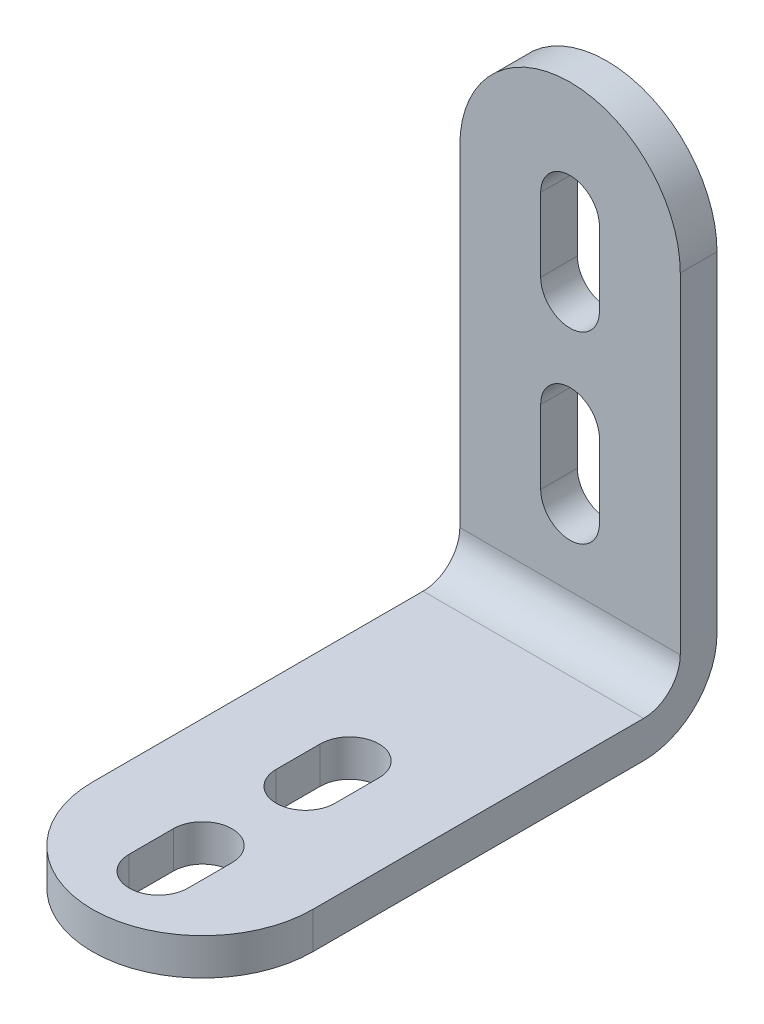
ISO-10303-21;
HEADER;
FILE_DESCRIPTION(('STEP AP214'),'2;1');
FILE_NAME('part.step','',(''),(''),'','','');
FILE_SCHEMA(('AUTOMOTIVE_DESIGN { 1 0 10303 214 1 1 1 1 }'));
ENDSEC;
DATA;
#1=APPLICATION_CONTEXT('core data for automotive mechanical design processes');
#2=APPLICATION_PROTOCOL_DEFINITION('international standard','automotive_design',2000,#1);
#3=PRODUCT_CONTEXT('',#1,'mechanical');
#4=PRODUCT('Part','Part','',(#3));
#5=PRODUCT_RELATED_PRODUCT_CATEGORY('part','',(#4));
#6=PRODUCT_DEFINITION_FORMATION('','',#4);
#7=PRODUCT_DEFINITION_CONTEXT('part definition',#1,'design');
#8=PRODUCT_DEFINITION('design','',#6,#7);
#9=PRODUCT_DEFINITION_SHAPE('','',#8);
#10=(LENGTH_UNIT() NAMED_UNIT(*) SI_UNIT(.MILLI.,.METRE.));
#11=(NAMED_UNIT(*) PLANE_ANGLE_UNIT() SI_UNIT($,.RADIAN.));
#12=(NAMED_UNIT(*) SI_UNIT($,.STERADIAN.) SOLID_ANGLE_UNIT());
#13=UNCERTAINTY_MEASURE_WITH_UNIT(LENGTH_MEASURE(1.E-05),#10,'distance_accuracy_value','');
#14=(GEOMETRIC_REPRESENTATION_CONTEXT(3) GLOBAL_UNCERTAINTY_ASSIGNED_CONTEXT((#13)) GLOBAL_UNIT_ASSIGNED_CONTEXT((#10,
#11,#12)) REPRESENTATION_CONTEXT('',''));
#15=CARTESIAN_POINT('',(0.,0.,0.));
#16=DIRECTION('',(0.,0.,1.));
#17=DIRECTION('',(1.,0.,0.));
#18=AXIS2_PLACEMENT_3D('',#15,#16,#17);
#19=CARTESIAN_POINT('',(0.,0.,55.));
#20=DIRECTION('',(0.,1.,0.));
#21=DIRECTION('',(0.,0.,1.));
#22=AXIS2_PLACEMENT_3D('',#19,#20,#21);
#23=CYLINDRICAL_SURFACE('',#22,15.);
#24=DIRECTION('',(0.,1.,0.));
#25=VECTOR('',#24,1.);
#26=CARTESIAN_POINT('',(-15.,0.,55.));
#27=LINE('',#26,#25);
#28=CARTESIAN_POINT('',(-15.,0.,55.));
#29=VERTEX_POINT('',#28);
#30=CARTESIAN_POINT('',(-15.,4.99999999999999,55.));
#31=VERTEX_POINT('',#30);
#32=EDGE_CURVE('E378',#29,#31,#27,.T.);
#33=ORIENTED_EDGE('',*,*,#32,.F.);
#34=CARTESIAN_POINT('',(0.,0.,55.));
#35=DIRECTION('',(0.,1.,0.));
#36=DIRECTION('',(0.,0.,1.));
#37=AXIS2_PLACEMENT_3D('',#34,#35,#36);
#38=CIRCLE('',#37,15.);
#39=CARTESIAN_POINT('',(15.,0.,55.));
#40=VERTEX_POINT('',#39);
#41=EDGE_CURVE('E42',#40,#29,#38,.F.);
#42=ORIENTED_EDGE('',*,*,#41,.F.);
#43=DIRECTION('',(0.,-1.,0.));
#44=VECTOR('',#43,1.);
#45=CARTESIAN_POINT('',(15.,70.,55.));
#46=LINE('',#45,#44);
#47=CARTESIAN_POINT('',(15.,4.99999999999999,55.));
#48=VERTEX_POINT('',#47);
#49=EDGE_CURVE('E381',#48,#40,#46,.T.);
#50=ORIENTED_EDGE('',*,*,#49,.F.);
#51=CARTESIAN_POINT('',(0.,4.99999999999999,55.));
#52=DIRECTION('',(0.,1.,0.));
#53=DIRECTION('',(0.,0.,1.));
#54=AXIS2_PLACEMENT_3D('',#51,#52,#53);
#55=CIRCLE('',#54,15.);
#56=EDGE_CURVE('E11',#31,#48,#55,.T.);
#57=ORIENTED_EDGE('',*,*,#56,.F.);
#58=EDGE_LOOP('',(#33,#42,#50,#57));
#59=FACE_BOUND('',#58,.T.);
#60=ADVANCED_FACE('F35',(#59),#23,.T.);
#61=CARTESIAN_POINT('',(0.,55.,5.00000000000001));
#62=DIRECTION('',(0.,0.,1.));
#63=DIRECTION('',(0.,-1.,0.));
#64=AXIS2_PLACEMENT_3D('',#61,#62,#63);
#65=CYLINDRICAL_SURFACE('',#64,15.);
#66=DIRECTION('',(0.,0.,1.));
#67=VECTOR('',#66,1.);
#68=CARTESIAN_POINT('',(-15.,55.,10.0000000000001));
#69=LINE('',#68,#67);
#70=CARTESIAN_POINT('',(-15.,55.,5.00000000000001));
#71=VERTEX_POINT('',#70);
#72=CARTESIAN_POINT('',(-15.,55.,0.));
#73=VERTEX_POINT('',#72);
#74=EDGE_CURVE('E349',#71,#73,#69,.F.);
#75=ORIENTED_EDGE('',*,*,#74,.F.);
#76=CARTESIAN_POINT('',(0.,55.,5.00000000000001));
#77=DIRECTION('',(0.,0.,1.));
#78=DIRECTION('',(0.,-1.,0.));
#79=AXIS2_PLACEMENT_3D('',#76,#77,#78);
#80=CIRCLE('',#79,15.);
#81=CARTESIAN_POINT('',(15.,55.,5.00000000000001));
#82=VERTEX_POINT('',#81);
#83=EDGE_CURVE('E374',#82,#71,#80,.T.);
#84=ORIENTED_EDGE('',*,*,#83,.F.);
#85=DIRECTION('',(0.,0.,-1.));
#86=VECTOR('',#85,1.);
#87=CARTESIAN_POINT('',(15.,55.,0.));
#88=LINE('',#87,#86);
#89=CARTESIAN_POINT('',(15.,55.,0.));
#90=VERTEX_POINT('',#89);
#91=EDGE_CURVE('E371',#90,#82,#88,.F.);
#92=ORIENTED_EDGE('',*,*,#91,.F.);
#93=CARTESIAN_POINT('',(0.,55.,0.));
#94=DIRECTION('',(0.,0.,1.));
#95=DIRECTION('',(0.,-1.,0.));
#96=AXIS2_PLACEMENT_3D('',#93,#94,#95);
#97=CIRCLE('',#96,15.);
#98=EDGE_CURVE('E376',#73,#90,#97,.F.);
#99=ORIENTED_EDGE('',*,*,#98,.F.);
#100=EDGE_LOOP('',(#75,#84,#92,#99));
#101=FACE_BOUND('',#100,.T.);
#102=ADVANCED_FACE('F417',(#101),#65,.T.);
#103=CARTESIAN_POINT('',(-15.,0.,10.0000000000001));
#104=DIRECTION('',(-1.,0.,0.));
#105=DIRECTION('',(0.,0.,1.));
#106=AXIS2_PLACEMENT_3D('',#103,#104,#105);
#107=PLANE('',#106);
#108=DIRECTION('',(0.,0.,1.));
#109=VECTOR('',#108,1.);
#110=CARTESIAN_POINT('',(-15.,0.,10.0000000000001));
#111=LINE('',#110,#109);
#112=CARTESIAN_POINT('',(-15.,0.,10.0000000000001));
#113=VERTEX_POINT('',#112);
#114=EDGE_CURVE('E356',#113,#29,#111,.T.);
#115=ORIENTED_EDGE('',*,*,#114,.T.);
#116=ORIENTED_EDGE('',*,*,#32,.T.);
#117=DIRECTION('',(0.,0.,1.));
#118=VECTOR('',#117,1.);
#119=CARTESIAN_POINT('',(-15.,5.,10.0000000000001));
#120=LINE('',#119,#118);
#121=CARTESIAN_POINT('',(-15.,5.,10.0000000000001));
#122=VERTEX_POINT('',#121);
#123=EDGE_CURVE('E335',#122,#31,#120,.T.);
#124=ORIENTED_EDGE('',*,*,#123,.F.);
#125=CARTESIAN_POINT('',(-15.,10.,10.));
#126=DIRECTION('',(1.,0.,0.));
#127=DIRECTION('',(0.,0.,-1.));
#128=AXIS2_PLACEMENT_3D('',#125,#126,#127);
#129=CIRCLE('',#128,5.);
#130=CARTESIAN_POINT('',(-15.,10.,5.));
#131=VERTEX_POINT('',#130);
#132=EDGE_CURVE('E330',#131,#122,#129,.F.);
#133=ORIENTED_EDGE('',*,*,#132,.F.);
#134=DIRECTION('',(0.,-1.,0.));
#135=VECTOR('',#134,1.);
#136=CARTESIAN_POINT('',(-15.,70.,5.00000000000001));
#137=LINE('',#136,#135);
#138=EDGE_CURVE('E339',#71,#131,#137,.T.);
#139=ORIENTED_EDGE('',*,*,#138,.F.);
#140=ORIENTED_EDGE('',*,*,#74,.T.);
#141=DIRECTION('',(0.,-1.,0.));
#142=VECTOR('',#141,1.);
#143=CARTESIAN_POINT('',(-15.,70.,0.));
#144=LINE('',#143,#142);
#145=CARTESIAN_POINT('',(-15.,10.0000000000001,0.));
#146=VERTEX_POINT('',#145);
#147=EDGE_CURVE('E344',#73,#146,#144,.T.);
#148=ORIENTED_EDGE('',*,*,#147,.T.);
#149=CARTESIAN_POINT('',(-15.,10.,10.));
#150=DIRECTION('',(-1.,0.,0.));
#151=DIRECTION('',(0.,0.,1.));
#152=AXIS2_PLACEMENT_3D('',#149,#150,#151);
#153=CIRCLE('',#152,10.);
#154=EDGE_CURVE('E352',#146,#113,#153,.T.);
#155=ORIENTED_EDGE('',*,*,#154,.T.);
#156=EDGE_LOOP('',(#115,#116,#124,#133,#139,#140,#148,#155));
#157=FACE_BOUND('',#156,.T.);
#158=ADVANCED_FACE('F392',(#157),#107,.T.);
#159=CARTESIAN_POINT('',(15.,70.,0.));
#160=DIRECTION('',(-1.,0.,0.));
#161=DIRECTION('',(0.,-1.,0.));
#162=AXIS2_PLACEMENT_3D('',#159,#160,#161);
#163=PLANE('',#162);
#164=DIRECTION('',(0.,0.,1.));
#165=VECTOR('',#164,1.);
#166=CARTESIAN_POINT('',(15.,5.,10.0000000000001));
#167=LINE('',#166,#165);
#168=CARTESIAN_POINT('',(15.,5.,10.));
#169=VERTEX_POINT('',#168);
#170=EDGE_CURVE('E336',#169,#48,#167,.T.);
#171=ORIENTED_EDGE('',*,*,#170,.T.);
#172=ORIENTED_EDGE('',*,*,#49,.T.);
#173=DIRECTION('',(0.,0.,1.));
#174=VECTOR('',#173,1.);
#175=CARTESIAN_POINT('',(15.,0.,10.0000000000001));
#176=LINE('',#175,#174);
#177=CARTESIAN_POINT('',(15.,0.,10.0000000000001));
#178=VERTEX_POINT('',#177);
#179=EDGE_CURVE('E320',#178,#40,#176,.T.);
#180=ORIENTED_EDGE('',*,*,#179,.F.);
#181=CARTESIAN_POINT('',(15.,10.,10.));
#182=DIRECTION('',(-1.,0.,0.));
#183=DIRECTION('',(0.,0.,1.));
#184=AXIS2_PLACEMENT_3D('',#181,#182,#183);
#185=CIRCLE('',#184,10.);
#186=CARTESIAN_POINT('',(15.,10.0000000000001,0.));
#187=VERTEX_POINT('',#186);
#188=EDGE_CURVE('E359',#187,#178,#185,.T.);
#189=ORIENTED_EDGE('',*,*,#188,.F.);
#190=DIRECTION('',(0.,-1.,0.));
#191=VECTOR('',#190,1.);
#192=CARTESIAN_POINT('',(15.,70.,0.));
#193=LINE('',#192,#191);
#194=EDGE_CURVE('E351',#90,#187,#193,.T.);
#195=ORIENTED_EDGE('',*,*,#194,.F.);
#196=ORIENTED_EDGE('',*,*,#91,.T.);
#197=DIRECTION('',(0.,-1.,0.));
#198=VECTOR('',#197,1.);
#199=CARTESIAN_POINT('',(15.,70.,5.00000000000001));
#200=LINE('',#199,#198);
#201=CARTESIAN_POINT('',(15.,10.0000000000001,5.));
#202=VERTEX_POINT('',#201);
#203=EDGE_CURVE('E337',#82,#202,#200,.T.);
#204=ORIENTED_EDGE('',*,*,#203,.T.);
#205=CARTESIAN_POINT('',(15.,10.,10.));
#206=DIRECTION('',(1.,0.,0.));
#207=DIRECTION('',(0.,0.,-1.));
#208=AXIS2_PLACEMENT_3D('',#205,#206,#207);
#209=CIRCLE('',#208,5.);
#210=EDGE_CURVE('E331',#202,#169,#209,.F.);
#211=ORIENTED_EDGE('',*,*,#210,.T.);
#212=EDGE_LOOP('',(#171,#172,#180,#189,#195,#196,#204,#211));
#213=FACE_BOUND('',#212,.T.);
#214=ADVANCED_FACE('F401',(#213),#163,.F.);
#215=CARTESIAN_POINT('',(-15.,70.,5.00000000000001));
#216=DIRECTION('',(0.,0.,1.));
#217=DIRECTION('',(0.,-1.,0.));
#218=AXIS2_PLACEMENT_3D('',#215,#216,#217);
#219=PLANE('',#218);
#220=CARTESIAN_POINT('',(0.,20.,5.));
#221=DIRECTION('',(0.,0.,1.));
#222=DIRECTION('',(1.,0.,0.));
#223=AXIS2_PLACEMENT_3D('',#220,#221,#222);
#224=CIRCLE('',#223,4.);
#225=CARTESIAN_POINT('',(-4.,20.,5.));
#226=VERTEX_POINT('',#225);
#227=CARTESIAN_POINT('',(4.00000000000001,20.,5.));
#228=VERTEX_POINT('',#227);
#229=EDGE_CURVE('E49',#226,#228,#224,.T.);
#230=ORIENTED_EDGE('',*,*,#229,.F.);
#231=DIRECTION('',(0.,-1.,0.));
#232=VECTOR('',#231,1.);
#233=CARTESIAN_POINT('',(-4.,20.,5.));
#234=LINE('',#233,#232);
#235=CARTESIAN_POINT('',(-4.,30.,5.));
#236=VERTEX_POINT('',#235);
#237=EDGE_CURVE('E212',#236,#226,#234,.T.);
#238=ORIENTED_EDGE('',*,*,#237,.F.);
#239=CARTESIAN_POINT('',(0.,30.,5.));
#240=DIRECTION('',(0.,0.,1.));
#241=DIRECTION('',(1.,0.,0.));
#242=AXIS2_PLACEMENT_3D('',#239,#240,#241);
#243=CIRCLE('',#242,4.);
#244=CARTESIAN_POINT('',(4.,30.,5.));
#245=VERTEX_POINT('',#244);
#246=EDGE_CURVE('E215',#245,#236,#243,.T.);
#247=ORIENTED_EDGE('',*,*,#246,.F.);
#248=DIRECTION('',(0.,1.,0.));
#249=VECTOR('',#248,1.);
#250=CARTESIAN_POINT('',(4.00000000000001,20.,5.));
#251=LINE('',#250,#249);
#252=EDGE_CURVE('E221',#228,#245,#251,.T.);
#253=ORIENTED_EDGE('',*,*,#252,.F.);
#254=EDGE_LOOP('',(#230,#238,#247,#253));
#255=FACE_BOUND('',#254,.T.);
#256=CARTESIAN_POINT('',(0.,55.,5.));
#257=DIRECTION('',(0.,0.,1.));
#258=DIRECTION('',(1.,0.,0.));
#259=AXIS2_PLACEMENT_3D('',#256,#257,#258);
#260=CIRCLE('',#259,4.00000000000002);
#261=CARTESIAN_POINT('',(4.00000000000002,55.,5.));
#262=VERTEX_POINT('',#261);
#263=CARTESIAN_POINT('',(-4.00000000000002,55.,5.00000000000001));
#264=VERTEX_POINT('',#263);
#265=EDGE_CURVE('E227',#262,#264,#260,.T.);
#266=ORIENTED_EDGE('',*,*,#265,.F.);
#267=DIRECTION('',(0.,1.,0.));
#268=VECTOR('',#267,1.);
#269=CARTESIAN_POINT('',(4.00000000000002,55.,5.));
#270=LINE('',#269,#268);
#271=CARTESIAN_POINT('',(4.00000000000002,45.,5.));
#272=VERTEX_POINT('',#271);
#273=EDGE_CURVE('E235',#272,#262,#270,.T.);
#274=ORIENTED_EDGE('',*,*,#273,.F.);
#275=CARTESIAN_POINT('',(0.,45.,5.));
#276=DIRECTION('',(0.,0.,1.));
#277=DIRECTION('',(1.,0.,0.));
#278=AXIS2_PLACEMENT_3D('',#275,#276,#277);
#279=CIRCLE('',#278,4.00000000000002);
#280=CARTESIAN_POINT('',(-4.00000000000001,45.,5.));
#281=VERTEX_POINT('',#280);
#282=EDGE_CURVE('E249',#281,#272,#279,.T.);
#283=ORIENTED_EDGE('',*,*,#282,.F.);
#284=DIRECTION('',(0.,-1.,0.));
#285=VECTOR('',#284,1.);
#286=CARTESIAN_POINT('',(-4.00000000000001,55.,5.));
#287=LINE('',#286,#285);
#288=EDGE_CURVE('E246',#264,#281,#287,.T.);
#289=ORIENTED_EDGE('',*,*,#288,.F.);
#290=EDGE_LOOP('',(#266,#274,#283,#289));
#291=FACE_BOUND('',#290,.T.);
#292=ORIENTED_EDGE('',*,*,#203,.F.);
#293=ORIENTED_EDGE('',*,*,#83,.T.);
#294=ORIENTED_EDGE('',*,*,#138,.T.);
#295=DIRECTION('',(1.,0.,0.));
#296=VECTOR('',#295,1.);
#297=CARTESIAN_POINT('',(-15.,10.0000000000001,5.));
#298=LINE('',#297,#296);
#299=EDGE_CURVE('E327',#131,#202,#298,.T.);
#300=ORIENTED_EDGE('',*,*,#299,.T.);
#301=EDGE_LOOP('',(#292,#293,#294,#300));
#302=FACE_BOUND('',#301,.T.);
#303=ADVANCED_FACE('F413',(#255,#291,#302),#219,.T.);
#304=CARTESIAN_POINT('',(-15.,10.,10.));
#305=DIRECTION('',(1.,0.,0.));
#306=DIRECTION('',(0.,0.,-1.));
#307=AXIS2_PLACEMENT_3D('',#304,#305,#306);
#308=CYLINDRICAL_SURFACE('',#307,5.);
#309=ORIENTED_EDGE('',*,*,#210,.F.);
#310=ORIENTED_EDGE('',*,*,#299,.F.);
#311=ORIENTED_EDGE('',*,*,#132,.T.);
#312=DIRECTION('',(1.,0.,0.));
#313=VECTOR('',#312,1.);
#314=CARTESIAN_POINT('',(-15.,5.,10.));
#315=LINE('',#314,#313);
#316=EDGE_CURVE('E332',#122,#169,#315,.T.);
#317=ORIENTED_EDGE('',*,*,#316,.T.);
#318=EDGE_LOOP('',(#309,#310,#311,#317));
#319=FACE_BOUND('',#318,.T.);
#320=ADVANCED_FACE('F410',(#319),#308,.F.);
#321=CARTESIAN_POINT('',(-15.,5.,10.0000000000001));
#322=DIRECTION('',(0.,1.,0.));
#323=DIRECTION('',(0.,0.,1.));
#324=AXIS2_PLACEMENT_3D('',#321,#322,#323);
#325=PLANE('',#324);
#326=CARTESIAN_POINT('',(0.,4.99999999999999,55.));
#327=DIRECTION('',(0.,1.,0.));
#328=DIRECTION('',(0.,0.,1.));
#329=AXIS2_PLACEMENT_3D('',#326,#327,#328);
#330=CIRCLE('',#329,4.);
#331=CARTESIAN_POINT('',(4.,4.99999999999999,55.));
#332=VERTEX_POINT('',#331);
#333=CARTESIAN_POINT('',(-4.,4.99999999999999,55.));
#334=VERTEX_POINT('',#333);
#335=EDGE_CURVE('E256',#332,#334,#330,.T.);
#336=ORIENTED_EDGE('',*,*,#335,.F.);
#337=DIRECTION('',(0.,0.,-1.));
#338=VECTOR('',#337,1.);
#339=CARTESIAN_POINT('',(4.,4.99999999999999,55.));
#340=LINE('',#339,#338);
#341=CARTESIAN_POINT('',(4.,4.99999999999999,61.));
#342=VERTEX_POINT('',#341);
#343=EDGE_CURVE('E267',#342,#332,#340,.T.);
#344=ORIENTED_EDGE('',*,*,#343,.F.);
#345=CARTESIAN_POINT('',(0.,4.99999999999999,61.));
#346=DIRECTION('',(0.,1.,0.));
#347=DIRECTION('',(0.,0.,1.));
#348=AXIS2_PLACEMENT_3D('',#345,#346,#347);
#349=CIRCLE('',#348,4.);
#350=CARTESIAN_POINT('',(-4.,4.99999999999999,61.));
#351=VERTEX_POINT('',#350);
#352=EDGE_CURVE('E281',#351,#342,#349,.T.);
#353=ORIENTED_EDGE('',*,*,#352,.F.);
#354=DIRECTION('',(0.,0.,1.));
#355=VECTOR('',#354,1.);
#356=CARTESIAN_POINT('',(-4.,4.99999999999999,55.));
#357=LINE('',#356,#355);
#358=EDGE_CURVE('E278',#334,#351,#357,.T.);
#359=ORIENTED_EDGE('',*,*,#358,.F.);
#360=EDGE_LOOP('',(#336,#344,#353,#359));
#361=FACE_BOUND('',#360,.T.);
#362=CARTESIAN_POINT('',(0.,5.,35.));
#363=DIRECTION('',(0.,1.,0.));
#364=DIRECTION('',(0.,0.,1.));
#365=AXIS2_PLACEMENT_3D('',#362,#363,#364);
#366=CIRCLE('',#365,4.);
#367=CARTESIAN_POINT('',(4.,5.,35.));
#368=VERTEX_POINT('',#367);
#369=CARTESIAN_POINT('',(-4.,5.,35.));
#370=VERTEX_POINT('',#369);
#371=EDGE_CURVE('E288',#368,#370,#366,.T.);
#372=ORIENTED_EDGE('',*,*,#371,.F.);
#373=DIRECTION('',(0.,0.,-1.));
#374=VECTOR('',#373,1.);
#375=CARTESIAN_POINT('',(4.,5.,35.));
#376=LINE('',#375,#374);
#377=CARTESIAN_POINT('',(4.,5.,41.));
#378=VERTEX_POINT('',#377);
#379=EDGE_CURVE('E299',#378,#368,#376,.T.);
#380=ORIENTED_EDGE('',*,*,#379,.F.);
#381=CARTESIAN_POINT('',(0.,5.,41.));
#382=DIRECTION('',(0.,1.,0.));
#383=DIRECTION('',(0.,0.,1.));
#384=AXIS2_PLACEMENT_3D('',#381,#382,#383);
#385=CIRCLE('',#384,4.);
#386=CARTESIAN_POINT('',(-4.,5.,41.));
#387=VERTEX_POINT('',#386);
#388=EDGE_CURVE('E313',#387,#378,#385,.T.);
#389=ORIENTED_EDGE('',*,*,#388,.F.);
#390=DIRECTION('',(0.,0.,1.));
#391=VECTOR('',#390,1.);
#392=CARTESIAN_POINT('',(-4.,5.,35.));
#393=LINE('',#392,#391);
#394=EDGE_CURVE('E310',#370,#387,#393,.T.);
#395=ORIENTED_EDGE('',*,*,#394,.F.);
#396=EDGE_LOOP('',(#372,#380,#389,#395));
#397=FACE_BOUND('',#396,.T.);
#398=ORIENTED_EDGE('',*,*,#123,.T.);
#399=ORIENTED_EDGE('',*,*,#56,.T.);
#400=ORIENTED_EDGE('',*,*,#170,.F.);
#401=ORIENTED_EDGE('',*,*,#316,.F.);
#402=EDGE_LOOP('',(#398,#399,#400,#401));
#403=FACE_BOUND('',#402,.T.);
#404=ADVANCED_FACE('F405',(#361,#397,#403),#325,.T.);
#405=CARTESIAN_POINT('',(-15.,70.,0.));
#406=DIRECTION('',(0.,0.,1.));
#407=DIRECTION('',(0.,-1.,0.));
#408=AXIS2_PLACEMENT_3D('',#405,#406,#407);
#409=PLANE('',#408);
#410=DIRECTION('',(0.,-1.,0.));
#411=VECTOR('',#410,1.);
#412=CARTESIAN_POINT('',(-4.,20.,0.));
#413=LINE('',#412,#411);
#414=CARTESIAN_POINT('',(-4.,30.,0.));
#415=VERTEX_POINT('',#414);
#416=CARTESIAN_POINT('',(-4.,20.,0.));
#417=VERTEX_POINT('',#416);
#418=EDGE_CURVE('E202',#415,#417,#413,.T.);
#419=ORIENTED_EDGE('',*,*,#418,.T.);
#420=CARTESIAN_POINT('',(0.,20.,0.));
#421=DIRECTION('',(0.,0.,1.));
#422=DIRECTION('',(1.,0.,0.));
#423=AXIS2_PLACEMENT_3D('',#420,#421,#422);
#424=CIRCLE('',#423,4.);
#425=CARTESIAN_POINT('',(4.00000000000001,20.,0.));
#426=VERTEX_POINT('',#425);
#427=EDGE_CURVE('E196',#417,#426,#424,.T.);
#428=ORIENTED_EDGE('',*,*,#427,.T.);
#429=DIRECTION('',(0.,1.,0.));
#430=VECTOR('',#429,1.);
#431=CARTESIAN_POINT('',(4.00000000000001,20.,0.));
#432=LINE('',#431,#430);
#433=CARTESIAN_POINT('',(4.00000000000001,30.,0.));
#434=VERTEX_POINT('',#433);
#435=EDGE_CURVE('E205',#426,#434,#432,.T.);
#436=ORIENTED_EDGE('',*,*,#435,.T.);
#437=CARTESIAN_POINT('',(0.,30.,0.));
#438=DIRECTION('',(0.,0.,1.));
#439=DIRECTION('',(1.,0.,0.));
#440=AXIS2_PLACEMENT_3D('',#437,#438,#439);
#441=CIRCLE('',#440,4.);
#442=EDGE_CURVE('E57',#434,#415,#441,.T.);
#443=ORIENTED_EDGE('',*,*,#442,.T.);
#444=EDGE_LOOP('',(#419,#428,#436,#443));
#445=FACE_BOUND('',#444,.T.);
#446=DIRECTION('',(0.,1.,0.));
#447=VECTOR('',#446,1.);
#448=CARTESIAN_POINT('',(4.00000000000002,55.,0.));
#449=LINE('',#448,#447);
#450=CARTESIAN_POINT('',(4.00000000000002,45.,0.));
#451=VERTEX_POINT('',#450);
#452=CARTESIAN_POINT('',(4.00000000000002,55.,0.));
#453=VERTEX_POINT('',#452);
#454=EDGE_CURVE('E241',#451,#453,#449,.T.);
#455=ORIENTED_EDGE('',*,*,#454,.T.);
#456=CARTESIAN_POINT('',(0.,55.,0.));
#457=DIRECTION('',(0.,0.,1.));
#458=DIRECTION('',(1.,0.,0.));
#459=AXIS2_PLACEMENT_3D('',#456,#457,#458);
#460=CIRCLE('',#459,4.00000000000002);
#461=CARTESIAN_POINT('',(-4.00000000000001,55.,0.));
#462=VERTEX_POINT('',#461);
#463=EDGE_CURVE('E231',#453,#462,#460,.T.);
#464=ORIENTED_EDGE('',*,*,#463,.T.);
#465=DIRECTION('',(0.,-1.,0.));
#466=VECTOR('',#465,1.);
#467=CARTESIAN_POINT('',(-4.00000000000001,55.,0.));
#468=LINE('',#467,#466);
#469=CARTESIAN_POINT('',(-4.00000000000001,45.,0.));
#470=VERTEX_POINT('',#469);
#471=EDGE_CURVE('E234',#462,#470,#468,.T.);
#472=ORIENTED_EDGE('',*,*,#471,.T.);
#473=CARTESIAN_POINT('',(0.,45.,0.));
#474=DIRECTION('',(0.,0.,1.));
#475=DIRECTION('',(1.,0.,0.));
#476=AXIS2_PLACEMENT_3D('',#473,#474,#475);
#477=CIRCLE('',#476,4.00000000000002);
#478=EDGE_CURVE('E238',#470,#451,#477,.T.);
#479=ORIENTED_EDGE('',*,*,#478,.T.);
#480=EDGE_LOOP('',(#455,#464,#472,#479));
#481=FACE_BOUND('',#480,.T.);
#482=ORIENTED_EDGE('',*,*,#147,.F.);
#483=ORIENTED_EDGE('',*,*,#98,.T.);
#484=ORIENTED_EDGE('',*,*,#194,.T.);
#485=DIRECTION('',(1.,0.,0.));
#486=VECTOR('',#485,1.);
#487=CARTESIAN_POINT('',(-15.,10.0000000000001,0.));
#488=LINE('',#487,#486);
#489=EDGE_CURVE('E355',#146,#187,#488,.T.);
#490=ORIENTED_EDGE('',*,*,#489,.F.);
#491=EDGE_LOOP('',(#482,#483,#484,#490));
#492=FACE_BOUND('',#491,.T.);
#493=ADVANCED_FACE('F209',(#445,#481,#492),#409,.F.);
#494=CARTESIAN_POINT('',(-15.,10.,10.));
#495=DIRECTION('',(1.,0.,0.));
#496=DIRECTION('',(0.,0.,-1.));
#497=AXIS2_PLACEMENT_3D('',#494,#495,#496);
#498=CYLINDRICAL_SURFACE('',#497,10.);
#499=ORIENTED_EDGE('',*,*,#188,.T.);
#500=DIRECTION('',(1.,0.,0.));
#501=VECTOR('',#500,1.);
#502=CARTESIAN_POINT('',(-15.,0.,10.0000000000001));
#503=LINE('',#502,#501);
#504=EDGE_CURVE('E360',#113,#178,#503,.T.);
#505=ORIENTED_EDGE('',*,*,#504,.F.);
#506=ORIENTED_EDGE('',*,*,#154,.F.);
#507=ORIENTED_EDGE('',*,*,#489,.T.);
#508=EDGE_LOOP('',(#499,#505,#506,#507));
#509=FACE_BOUND('',#508,.T.);
#510=ADVANCED_FACE('F397',(#509),#498,.T.);
#511=CARTESIAN_POINT('',(-15.,0.,10.0000000000001));
#512=DIRECTION('',(0.,1.,0.));
#513=DIRECTION('',(0.,0.,1.));
#514=AXIS2_PLACEMENT_3D('',#511,#512,#513);
#515=PLANE('',#514);
#516=DIRECTION('',(0.,0.,-1.));
#517=VECTOR('',#516,1.);
#518=CARTESIAN_POINT('',(4.,0.,55.));
#519=LINE('',#518,#517);
#520=CARTESIAN_POINT('',(4.,0.,61.));
#521=VERTEX_POINT('',#520);
#522=CARTESIAN_POINT('',(4.,0.,55.));
#523=VERTEX_POINT('',#522);
#524=EDGE_CURVE('E273',#521,#523,#519,.T.);
#525=ORIENTED_EDGE('',*,*,#524,.T.);
#526=CARTESIAN_POINT('',(0.,0.,55.));
#527=DIRECTION('',(0.,1.,0.));
#528=DIRECTION('',(0.,0.,1.));
#529=AXIS2_PLACEMENT_3D('',#526,#527,#528);
#530=CIRCLE('',#529,4.);
#531=CARTESIAN_POINT('',(-4.,0.,55.));
#532=VERTEX_POINT('',#531);
#533=EDGE_CURVE('E263',#523,#532,#530,.T.);
#534=ORIENTED_EDGE('',*,*,#533,.T.);
#535=DIRECTION('',(0.,0.,1.));
#536=VECTOR('',#535,1.);
#537=CARTESIAN_POINT('',(-4.,0.,55.));
#538=LINE('',#537,#536);
#539=CARTESIAN_POINT('',(-4.,0.,61.));
#540=VERTEX_POINT('',#539);
#541=EDGE_CURVE('E266',#532,#540,#538,.T.);
#542=ORIENTED_EDGE('',*,*,#541,.T.);
#543=CARTESIAN_POINT('',(0.,0.,61.));
#544=DIRECTION('',(0.,1.,0.));
#545=DIRECTION('',(0.,0.,1.));
#546=AXIS2_PLACEMENT_3D('',#543,#544,#545);
#547=CIRCLE('',#546,4.);
#548=EDGE_CURVE('E270',#540,#521,#547,.T.);
#549=ORIENTED_EDGE('',*,*,#548,.T.);
#550=EDGE_LOOP('',(#525,#534,#542,#549));
#551=FACE_BOUND('',#550,.T.);
#552=DIRECTION('',(0.,0.,-1.));
#553=VECTOR('',#552,1.);
#554=CARTESIAN_POINT('',(4.,0.,35.));
#555=LINE('',#554,#553);
#556=CARTESIAN_POINT('',(4.,0.,41.));
#557=VERTEX_POINT('',#556);
#558=CARTESIAN_POINT('',(4.,0.,35.));
#559=VERTEX_POINT('',#558);
#560=EDGE_CURVE('E305',#557,#559,#555,.T.);
#561=ORIENTED_EDGE('',*,*,#560,.T.);
#562=CARTESIAN_POINT('',(0.,0.,35.));
#563=DIRECTION('',(0.,1.,0.));
#564=DIRECTION('',(0.,0.,1.));
#565=AXIS2_PLACEMENT_3D('',#562,#563,#564);
#566=CIRCLE('',#565,4.);
#567=CARTESIAN_POINT('',(-4.,0.,35.));
#568=VERTEX_POINT('',#567);
#569=EDGE_CURVE('E295',#559,#568,#566,.T.);
#570=ORIENTED_EDGE('',*,*,#569,.T.);
#571=DIRECTION('',(0.,0.,1.));
#572=VECTOR('',#571,1.);
#573=CARTESIAN_POINT('',(-4.,0.,35.));
#574=LINE('',#573,#572);
#575=CARTESIAN_POINT('',(-4.,0.,41.));
#576=VERTEX_POINT('',#575);
#577=EDGE_CURVE('E298',#568,#576,#574,.T.);
#578=ORIENTED_EDGE('',*,*,#577,.T.);
#579=CARTESIAN_POINT('',(0.,0.,41.));
#580=DIRECTION('',(0.,1.,0.));
#581=DIRECTION('',(0.,0.,1.));
#582=AXIS2_PLACEMENT_3D('',#579,#580,#581);
#583=CIRCLE('',#582,4.);
#584=EDGE_CURVE('E302',#576,#557,#583,.T.);
#585=ORIENTED_EDGE('',*,*,#584,.T.);
#586=EDGE_LOOP('',(#561,#570,#578,#585));
#587=FACE_BOUND('',#586,.T.);
#588=ORIENTED_EDGE('',*,*,#179,.T.);
#589=ORIENTED_EDGE('',*,*,#41,.T.);
#590=ORIENTED_EDGE('',*,*,#114,.F.);
#591=ORIENTED_EDGE('',*,*,#504,.T.);
#592=EDGE_LOOP('',(#588,#589,#590,#591));
#593=FACE_BOUND('',#592,.T.);
#594=ADVANCED_FACE('F386',(#551,#587,#593),#515,.F.);
#595=CARTESIAN_POINT('',(0.,0.,35.));
#596=DIRECTION('',(0.,1.,0.));
#597=DIRECTION('',(0.,0.,1.));
#598=AXIS2_PLACEMENT_3D('',#595,#596,#597);
#599=CYLINDRICAL_SURFACE('',#598,4.);
#600=ORIENTED_EDGE('',*,*,#371,.T.);
#601=DIRECTION('',(0.,1.,0.));
#602=VECTOR('',#601,1.);
#603=CARTESIAN_POINT('',(-4.,0.,35.));
#604=LINE('',#603,#602);
#605=EDGE_CURVE('E308',#568,#370,#604,.T.);
#606=ORIENTED_EDGE('',*,*,#605,.F.);
#607=ORIENTED_EDGE('',*,*,#569,.F.);
#608=DIRECTION('',(0.,1.,0.));
#609=VECTOR('',#608,1.);
#610=CARTESIAN_POINT('',(4.,0.,35.));
#611=LINE('',#610,#609);
#612=EDGE_CURVE('E318',#559,#368,#611,.T.);
#613=ORIENTED_EDGE('',*,*,#612,.T.);
#614=EDGE_LOOP('',(#600,#606,#607,#613));
#615=FACE_BOUND('',#614,.T.);
#616=ADVANCED_FACE('F449',(#615),#599,.F.);
#617=CARTESIAN_POINT('',(4.,0.,35.));
#618=DIRECTION('',(1.,0.,0.));
#619=DIRECTION('',(0.,0.,-1.));
#620=AXIS2_PLACEMENT_3D('',#617,#618,#619);
#621=PLANE('',#620);
#622=ORIENTED_EDGE('',*,*,#379,.T.);
#623=ORIENTED_EDGE('',*,*,#612,.F.);
#624=ORIENTED_EDGE('',*,*,#560,.F.);
#625=DIRECTION('',(0.,1.,0.));
#626=VECTOR('',#625,1.);
#627=CARTESIAN_POINT('',(4.,0.,41.));
#628=LINE('',#627,#626);
#629=EDGE_CURVE('E321',#557,#378,#628,.T.);
#630=ORIENTED_EDGE('',*,*,#629,.T.);
#631=EDGE_LOOP('',(#622,#623,#624,#630));
#632=FACE_BOUND('',#631,.T.);
#633=ADVANCED_FACE('F457',(#632),#621,.F.);
#634=CARTESIAN_POINT('',(0.,0.,41.));
#635=DIRECTION('',(0.,1.,0.));
#636=DIRECTION('',(0.,0.,1.));
#637=AXIS2_PLACEMENT_3D('',#634,#635,#636);
#638=CYLINDRICAL_SURFACE('',#637,4.);
#639=ORIENTED_EDGE('',*,*,#388,.T.);
#640=ORIENTED_EDGE('',*,*,#629,.F.);
#641=ORIENTED_EDGE('',*,*,#584,.F.);
#642=DIRECTION('',(0.,1.,0.));
#643=VECTOR('',#642,1.);
#644=CARTESIAN_POINT('',(-4.,0.,41.));
#645=LINE('',#644,#643);
#646=EDGE_CURVE('E323',#576,#387,#645,.T.);
#647=ORIENTED_EDGE('',*,*,#646,.T.);
#648=EDGE_LOOP('',(#639,#640,#641,#647));
#649=FACE_BOUND('',#648,.T.);
#650=ADVANCED_FACE('F473',(#649),#638,.F.);
#651=CARTESIAN_POINT('',(-4.,0.,35.));
#652=DIRECTION('',(-1.,0.,0.));
#653=DIRECTION('',(0.,0.,1.));
#654=AXIS2_PLACEMENT_3D('',#651,#652,#653);
#655=PLANE('',#654);
#656=ORIENTED_EDGE('',*,*,#394,.T.);
#657=ORIENTED_EDGE('',*,*,#646,.F.);
#658=ORIENTED_EDGE('',*,*,#577,.F.);
#659=ORIENTED_EDGE('',*,*,#605,.T.);
#660=EDGE_LOOP('',(#656,#657,#658,#659));
#661=FACE_BOUND('',#660,.T.);
#662=ADVANCED_FACE('F470',(#661),#655,.F.);
#663=CARTESIAN_POINT('',(0.,0.,55.));
#664=DIRECTION('',(0.,1.,0.));
#665=DIRECTION('',(0.,0.,1.));
#666=AXIS2_PLACEMENT_3D('',#663,#664,#665);
#667=CYLINDRICAL_SURFACE('',#666,4.);
#668=ORIENTED_EDGE('',*,*,#335,.T.);
#669=DIRECTION('',(0.,1.,0.));
#670=VECTOR('',#669,1.);
#671=CARTESIAN_POINT('',(-4.,0.,55.));
#672=LINE('',#671,#670);
#673=EDGE_CURVE('E276',#532,#334,#672,.T.);
#674=ORIENTED_EDGE('',*,*,#673,.F.);
#675=ORIENTED_EDGE('',*,*,#533,.F.);
#676=DIRECTION('',(0.,1.,0.));
#677=VECTOR('',#676,1.);
#678=CARTESIAN_POINT('',(4.,0.,55.));
#679=LINE('',#678,#677);
#680=EDGE_CURVE('E286',#523,#332,#679,.T.);
#681=ORIENTED_EDGE('',*,*,#680,.T.);
#682=EDGE_LOOP('',(#668,#674,#675,#681));
#683=FACE_BOUND('',#682,.T.);
#684=ADVANCED_FACE('F481',(#683),#667,.F.);
#685=CARTESIAN_POINT('',(4.,0.,55.));
#686=DIRECTION('',(1.,0.,0.));
#687=DIRECTION('',(0.,0.,-1.));
#688=AXIS2_PLACEMENT_3D('',#685,#686,#687);
#689=PLANE('',#688);
#690=ORIENTED_EDGE('',*,*,#343,.T.);
#691=ORIENTED_EDGE('',*,*,#680,.F.);
#692=ORIENTED_EDGE('',*,*,#524,.F.);
#693=DIRECTION('',(0.,1.,0.));
#694=VECTOR('',#693,1.);
#695=CARTESIAN_POINT('',(4.,0.,61.));
#696=LINE('',#695,#694);
#697=EDGE_CURVE('E289',#521,#342,#696,.T.);
#698=ORIENTED_EDGE('',*,*,#697,.T.);
#699=EDGE_LOOP('',(#690,#691,#692,#698));
#700=FACE_BOUND('',#699,.T.);
#701=ADVANCED_FACE('F486',(#700),#689,.F.);
#702=CARTESIAN_POINT('',(0.,0.,61.));
#703=DIRECTION('',(0.,1.,0.));
#704=DIRECTION('',(0.,0.,1.));
#705=AXIS2_PLACEMENT_3D('',#702,#703,#704);
#706=CYLINDRICAL_SURFACE('',#705,4.);
#707=ORIENTED_EDGE('',*,*,#352,.T.);
#708=ORIENTED_EDGE('',*,*,#697,.F.);
#709=ORIENTED_EDGE('',*,*,#548,.F.);
#710=DIRECTION('',(0.,1.,0.));
#711=VECTOR('',#710,1.);
#712=CARTESIAN_POINT('',(-4.,0.,61.));
#713=LINE('',#712,#711);
#714=EDGE_CURVE('E291',#540,#351,#713,.T.);
#715=ORIENTED_EDGE('',*,*,#714,.T.);
#716=EDGE_LOOP('',(#707,#708,#709,#715));
#717=FACE_BOUND('',#716,.T.);
#718=ADVANCED_FACE('F492',(#717),#706,.F.);
#719=CARTESIAN_POINT('',(-4.,0.,55.));
#720=DIRECTION('',(-1.,0.,0.));
#721=DIRECTION('',(0.,0.,1.));
#722=AXIS2_PLACEMENT_3D('',#719,#720,#721);
#723=PLANE('',#722);
#724=ORIENTED_EDGE('',*,*,#358,.T.);
#725=ORIENTED_EDGE('',*,*,#714,.F.);
#726=ORIENTED_EDGE('',*,*,#541,.F.);
#727=ORIENTED_EDGE('',*,*,#673,.T.);
#728=EDGE_LOOP('',(#724,#725,#726,#727));
#729=FACE_BOUND('',#728,.T.);
#730=ADVANCED_FACE('F488',(#729),#723,.F.);
#731=CARTESIAN_POINT('',(0.,55.,0.));
#732=DIRECTION('',(0.,0.,1.));
#733=DIRECTION('',(1.,0.,0.));
#734=AXIS2_PLACEMENT_3D('',#731,#732,#733);
#735=CYLINDRICAL_SURFACE('',#734,4.00000000000002);
#736=ORIENTED_EDGE('',*,*,#265,.T.);
#737=DIRECTION('',(0.,0.,1.));
#738=VECTOR('',#737,1.);
#739=CARTESIAN_POINT('',(-4.00000000000001,55.,0.));
#740=LINE('',#739,#738);
#741=EDGE_CURVE('E244',#462,#264,#740,.T.);
#742=ORIENTED_EDGE('',*,*,#741,.F.);
#743=ORIENTED_EDGE('',*,*,#463,.F.);
#744=DIRECTION('',(0.,0.,1.));
#745=VECTOR('',#744,1.);
#746=CARTESIAN_POINT('',(4.00000000000002,55.,0.));
#747=LINE('',#746,#745);
#748=EDGE_CURVE('E254',#453,#262,#747,.T.);
#749=ORIENTED_EDGE('',*,*,#748,.T.);
#750=EDGE_LOOP('',(#736,#742,#743,#749));
#751=FACE_BOUND('',#750,.T.);
#752=ADVANCED_FACE('F491',(#751),#735,.F.);
#753=CARTESIAN_POINT('',(4.00000000000002,55.,0.));
#754=DIRECTION('',(1.,0.,0.));
#755=DIRECTION('',(0.,1.,0.));
#756=AXIS2_PLACEMENT_3D('',#753,#754,#755);
#757=PLANE('',#756);
#758=ORIENTED_EDGE('',*,*,#273,.T.);
#759=ORIENTED_EDGE('',*,*,#748,.F.);
#760=ORIENTED_EDGE('',*,*,#454,.F.);
#761=DIRECTION('',(0.,0.,1.));
#762=VECTOR('',#761,1.);
#763=CARTESIAN_POINT('',(4.00000000000002,45.,0.));
#764=LINE('',#763,#762);
#765=EDGE_CURVE('E257',#451,#272,#764,.T.);
#766=ORIENTED_EDGE('',*,*,#765,.T.);
#767=EDGE_LOOP('',(#758,#759,#760,#766));
#768=FACE_BOUND('',#767,.T.);
#769=ADVANCED_FACE('F502',(#768),#757,.F.);
#770=CARTESIAN_POINT('',(0.,45.,0.));
#771=DIRECTION('',(0.,0.,1.));
#772=DIRECTION('',(1.,0.,0.));
#773=AXIS2_PLACEMENT_3D('',#770,#771,#772);
#774=CYLINDRICAL_SURFACE('',#773,4.00000000000002);
#775=ORIENTED_EDGE('',*,*,#282,.T.);
#776=ORIENTED_EDGE('',*,*,#765,.F.);
#777=ORIENTED_EDGE('',*,*,#478,.F.);
#778=DIRECTION('',(0.,0.,1.));
#779=VECTOR('',#778,1.);
#780=CARTESIAN_POINT('',(-4.00000000000001,45.,0.));
#781=LINE('',#780,#779);
#782=EDGE_CURVE('E259',#470,#281,#781,.T.);
#783=ORIENTED_EDGE('',*,*,#782,.T.);
#784=EDGE_LOOP('',(#775,#776,#777,#783));
#785=FACE_BOUND('',#784,.T.);
#786=ADVANCED_FACE('F507',(#785),#774,.F.);
#787=CARTESIAN_POINT('',(-4.00000000000001,55.,0.));
#788=DIRECTION('',(-1.,0.,0.));
#789=DIRECTION('',(0.,-1.,0.));
#790=AXIS2_PLACEMENT_3D('',#787,#788,#789);
#791=PLANE('',#790);
#792=ORIENTED_EDGE('',*,*,#288,.T.);
#793=ORIENTED_EDGE('',*,*,#782,.F.);
#794=ORIENTED_EDGE('',*,*,#471,.F.);
#795=ORIENTED_EDGE('',*,*,#741,.T.);
#796=EDGE_LOOP('',(#792,#793,#794,#795));
#797=FACE_BOUND('',#796,.T.);
#798=ADVANCED_FACE('F504',(#797),#791,.F.);
#799=CARTESIAN_POINT('',(0.,20.,0.));
#800=DIRECTION('',(0.,0.,1.));
#801=DIRECTION('',(1.,0.,0.));
#802=AXIS2_PLACEMENT_3D('',#799,#800,#801);
#803=CYLINDRICAL_SURFACE('',#802,4.);
#804=ORIENTED_EDGE('',*,*,#229,.T.);
#805=DIRECTION('',(0.,0.,1.));
#806=VECTOR('',#805,1.);
#807=CARTESIAN_POINT('',(4.00000000000001,20.,0.));
#808=LINE('',#807,#806);
#809=EDGE_CURVE('E192',#426,#228,#808,.T.);
#810=ORIENTED_EDGE('',*,*,#809,.F.);
#811=ORIENTED_EDGE('',*,*,#427,.F.);
#812=DIRECTION('',(0.,0.,1.));
#813=VECTOR('',#812,1.);
#814=CARTESIAN_POINT('',(-4.,20.,0.));
#815=LINE('',#814,#813);
#816=EDGE_CURVE('E225',#417,#226,#815,.T.);
#817=ORIENTED_EDGE('',*,*,#816,.T.);
#818=EDGE_LOOP('',(#804,#810,#811,#817));
#819=FACE_BOUND('',#818,.T.);
#820=ADVANCED_FACE('F194',(#819),#803,.F.);
#821=CARTESIAN_POINT('',(-4.,20.,0.));
#822=DIRECTION('',(-1.,0.,0.));
#823=DIRECTION('',(0.,-1.,0.));
#824=AXIS2_PLACEMENT_3D('',#821,#822,#823);
#825=PLANE('',#824);
#826=ORIENTED_EDGE('',*,*,#237,.T.);
#827=ORIENTED_EDGE('',*,*,#816,.F.);
#828=ORIENTED_EDGE('',*,*,#418,.F.);
#829=DIRECTION('',(0.,0.,1.));
#830=VECTOR('',#829,1.);
#831=CARTESIAN_POINT('',(-4.,30.,0.));
#832=LINE('',#831,#830);
#833=EDGE_CURVE('E228',#415,#236,#832,.T.);
#834=ORIENTED_EDGE('',*,*,#833,.T.);
#835=EDGE_LOOP('',(#826,#827,#828,#834));
#836=FACE_BOUND('',#835,.T.);
#837=ADVANCED_FACE('F517',(#836),#825,.F.);
#838=CARTESIAN_POINT('',(0.,30.,0.));
#839=DIRECTION('',(0.,0.,1.));
#840=DIRECTION('',(1.,0.,0.));
#841=AXIS2_PLACEMENT_3D('',#838,#839,#840);
#842=CYLINDRICAL_SURFACE('',#841,4.);
#843=ORIENTED_EDGE('',*,*,#246,.T.);
#844=ORIENTED_EDGE('',*,*,#833,.F.);
#845=ORIENTED_EDGE('',*,*,#442,.F.);
#846=DIRECTION('',(0.,0.,1.));
#847=VECTOR('',#846,1.);
#848=CARTESIAN_POINT('',(4.,30.,0.));
#849=LINE('',#848,#847);
#850=EDGE_CURVE('E201',#434,#245,#849,.T.);
#851=ORIENTED_EDGE('',*,*,#850,.T.);
#852=EDGE_LOOP('',(#843,#844,#845,#851));
#853=FACE_BOUND('',#852,.T.);
#854=ADVANCED_FACE('F520',(#853),#842,.F.);
#855=CARTESIAN_POINT('',(4.00000000000001,20.,0.));
#856=DIRECTION('',(1.,0.,0.));
#857=DIRECTION('',(0.,1.,0.));
#858=AXIS2_PLACEMENT_3D('',#855,#856,#857);
#859=PLANE('',#858);
#860=ORIENTED_EDGE('',*,*,#252,.T.);
#861=ORIENTED_EDGE('',*,*,#850,.F.);
#862=ORIENTED_EDGE('',*,*,#435,.F.);
#863=ORIENTED_EDGE('',*,*,#809,.T.);
#864=EDGE_LOOP('',(#860,#861,#862,#863));
#865=FACE_BOUND('',#864,.T.);
#866=ADVANCED_FACE('F206',(#865),#859,.F.);
#867=CLOSED_SHELL('',(#60,#102,#158,#214,#303,#320,#404,#493,#510,#594,#616,#633,#650,#662,#684,
#701,#718,#730,#752,#769,#786,#798,#820,#837,#854,#866));
#868=MANIFOLD_SOLID_BREP('B2',#867);
#869=ADVANCED_BREP_SHAPE_REPRESENTATION('',(#18,#868),#14);
#870=SHAPE_DEFINITION_REPRESENTATION(#9,#869);
ENDSEC;
END-ISO-10303-21;
